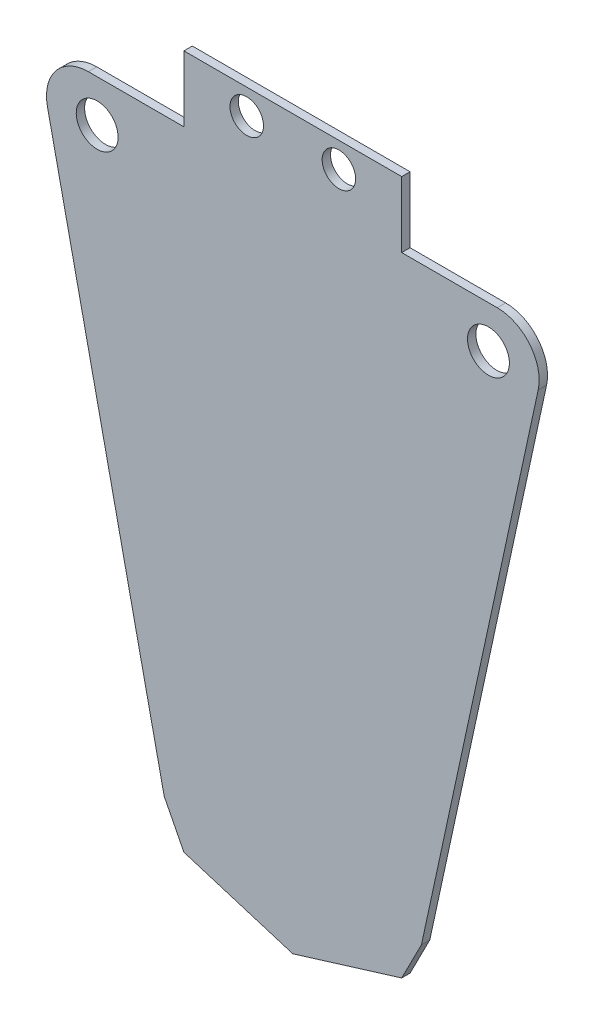
ISO-10303-21;
HEADER;
FILE_DESCRIPTION(('STEP AP214'),'2;1');
FILE_NAME('part.step','',(''),(''),'','','');
FILE_SCHEMA(('AUTOMOTIVE_DESIGN { 1 0 10303 214 1 1 1 1 }'));
ENDSEC;
DATA;
#1=APPLICATION_CONTEXT('core data for automotive mechanical design processes');
#2=APPLICATION_PROTOCOL_DEFINITION('international standard','automotive_design',2000,#1);
#3=PRODUCT_CONTEXT('',#1,'mechanical');
#4=PRODUCT('Part','Part','',(#3));
#5=PRODUCT_RELATED_PRODUCT_CATEGORY('part','',(#4));
#6=PRODUCT_DEFINITION_FORMATION('','',#4);
#7=PRODUCT_DEFINITION_CONTEXT('part definition',#1,'design');
#8=PRODUCT_DEFINITION('design','',#6,#7);
#9=PRODUCT_DEFINITION_SHAPE('','',#8);
#10=(LENGTH_UNIT() NAMED_UNIT(*) SI_UNIT(.MILLI.,.METRE.));
#11=(NAMED_UNIT(*) PLANE_ANGLE_UNIT() SI_UNIT($,.RADIAN.));
#12=(NAMED_UNIT(*) SI_UNIT($,.STERADIAN.) SOLID_ANGLE_UNIT());
#13=UNCERTAINTY_MEASURE_WITH_UNIT(LENGTH_MEASURE(1.E-05),#10,'distance_accuracy_value','');
#14=(GEOMETRIC_REPRESENTATION_CONTEXT(3) GLOBAL_UNCERTAINTY_ASSIGNED_CONTEXT((#13)) GLOBAL_UNIT_ASSIGNED_CONTEXT((#10,
#11,#12)) REPRESENTATION_CONTEXT('',''));
#15=CARTESIAN_POINT('',(0.,0.,0.));
#16=DIRECTION('',(0.,0.,1.));
#17=DIRECTION('',(1.,0.,0.));
#18=AXIS2_PLACEMENT_3D('',#15,#16,#17);
#19=CARTESIAN_POINT('',(25.9999999999999,-150.,-30.0000000000001));
#20=DIRECTION('',(0.294085848837525,-0.955779008721949,0.));
#21=DIRECTION('',(0.955779008721948,0.294085848837524,0.));
#22=AXIS2_PLACEMENT_3D('',#19,#20,#21);
#23=PLANE('',#22);
#24=DIRECTION('',(0.,0.,-1.));
#25=VECTOR('',#24,1.);
#26=CARTESIAN_POINT('',(25.9999999999999,-150.,-30.0000000000001));
#27=LINE('',#26,#25);
#28=CARTESIAN_POINT('',(25.9999999999997,-150.,-28.0000000000001));
#29=VERTEX_POINT('',#28);
#30=CARTESIAN_POINT('',(26.,-150.000000000002,-30.0000000000001));
#31=VERTEX_POINT('',#30);
#32=EDGE_CURVE('E307',#29,#31,#27,.T.);
#33=ORIENTED_EDGE('',*,*,#32,.F.);
#34=DIRECTION('',(0.955779008721948,0.294085848837524,0.));
#35=VECTOR('',#34,1.);
#36=CARTESIAN_POINT('',(25.9999999999999,-150.,-28.0000000000001));
#37=LINE('',#36,#35);
#38=CARTESIAN_POINT('',(-1.2490009027033E-13,-157.999999999999,-28.0000000000001));
#39=VERTEX_POINT('',#38);
#40=EDGE_CURVE('E289',#39,#29,#37,.T.);
#41=ORIENTED_EDGE('',*,*,#40,.F.);
#42=DIRECTION('',(0.,0.,-1.));
#43=VECTOR('',#42,1.);
#44=CARTESIAN_POINT('',(0.,-157.999999999999,-30.0000000000001));
#45=LINE('',#44,#43);
#46=CARTESIAN_POINT('',(0.,-157.999999999999,-30.0000000000001));
#47=VERTEX_POINT('',#46);
#48=EDGE_CURVE('E299',#39,#47,#45,.T.);
#49=ORIENTED_EDGE('',*,*,#48,.T.);
#50=DIRECTION('',(0.955779008721948,0.294085848837524,0.));
#51=VECTOR('',#50,1.);
#52=CARTESIAN_POINT('',(25.9999999999999,-150.,-30.0000000000001));
#53=LINE('',#52,#51);
#54=EDGE_CURVE('E293',#47,#31,#53,.T.);
#55=ORIENTED_EDGE('',*,*,#54,.T.);
#56=EDGE_LOOP('',(#33,#41,#49,#55));
#57=FACE_BOUND('',#56,.T.);
#58=ADVANCED_FACE('F86',(#57),#23,.T.);
#59=CARTESIAN_POINT('',(0.,-157.999999999999,-30.0000000000001));
#60=DIRECTION('',(-0.294085848837527,-0.955779008721949,0.));
#61=DIRECTION('',(0.955779008721947,-0.294085848837526,0.));
#62=AXIS2_PLACEMENT_3D('',#59,#60,#61);
#63=PLANE('',#62);
#64=ORIENTED_EDGE('',*,*,#48,.F.);
#65=DIRECTION('',(0.955779008721947,-0.294085848837526,0.));
#66=VECTOR('',#65,1.);
#67=CARTESIAN_POINT('',(0.,-157.999999999999,-28.0000000000001));
#68=LINE('',#67,#66);
#69=CARTESIAN_POINT('',(-25.9999999999999,-150.,-28.0000000000001));
#70=VERTEX_POINT('',#69);
#71=EDGE_CURVE('E296',#70,#39,#68,.T.);
#72=ORIENTED_EDGE('',*,*,#71,.F.);
#73=DIRECTION('',(0.,0.,-1.));
#74=VECTOR('',#73,1.);
#75=CARTESIAN_POINT('',(-25.9999999999999,-150.,-30.0000000000001));
#76=LINE('',#75,#74);
#77=CARTESIAN_POINT('',(-25.9999999999999,-150.,-30.0000000000001));
#78=VERTEX_POINT('',#77);
#79=EDGE_CURVE('E304',#70,#78,#76,.T.);
#80=ORIENTED_EDGE('',*,*,#79,.T.);
#81=DIRECTION('',(0.955779008721947,-0.294085848837526,0.));
#82=VECTOR('',#81,1.);
#83=CARTESIAN_POINT('',(0.,-157.999999999999,-30.0000000000001));
#84=LINE('',#83,#82);
#85=EDGE_CURVE('E295',#78,#47,#84,.T.);
#86=ORIENTED_EDGE('',*,*,#85,.T.);
#87=EDGE_LOOP('',(#64,#72,#80,#86));
#88=FACE_BOUND('',#87,.T.);
#89=ADVANCED_FACE('F348',(#88),#63,.T.);
#90=CARTESIAN_POINT('',(-25.9999999999999,-150.,-30.0000000000001));
#91=DIRECTION('',(0.,0.,1.));
#92=DIRECTION('',(0.999999999999998,0.,0.));
#93=AXIS2_PLACEMENT_3D('',#90,#91,#92);
#94=PLANE('',#93);
#95=ORIENTED_EDGE('',*,*,#85,.F.);
#96=DIRECTION('',(-0.454685701384504,0.890651959497357,0.));
#97=VECTOR('',#96,1.);
#98=CARTESIAN_POINT('',(-26.,-150.000000000002,-30.0000000000001));
#99=LINE('',#98,#97);
#100=CARTESIAN_POINT('',(-30.7123883849302,-140.7692326014,-30.0000000000001));
#101=VERTEX_POINT('',#100);
#102=EDGE_CURVE('E284',#78,#101,#99,.T.);
#103=ORIENTED_EDGE('',*,*,#102,.T.);
#104=DIRECTION('',(-0.211753347005807,0.977323140026803,0.));
#105=VECTOR('',#104,1.);
#106=CARTESIAN_POINT('',(-31.1337215208195,-138.824621809317,-30.0000000390462));
#107=LINE('',#106,#105);
#108=CARTESIAN_POINT('',(-58.5869239906599,-12.1175334869782,-30.0000000390462));
#109=VERTEX_POINT('',#108);
#110=EDGE_CURVE('E267',#101,#109,#107,.T.);
#111=ORIENTED_EDGE('',*,*,#110,.T.);
#112=CARTESIAN_POINT('',(-48.8136925903919,-10.0000000169203,-30.0000000390462));
#113=DIRECTION('',(0.,0.,0.999999999999998));
#114=DIRECTION('',(0.,1.00000000000001,0.));
#115=AXIS2_PLACEMENT_3D('',#112,#113,#114);
#116=CIRCLE('',#115,10.);
#117=CARTESIAN_POINT('',(-48.8136925903919,-1.69200209398923E-08,-30.0000000390462));
#118=VERTEX_POINT('',#117);
#119=EDGE_CURVE('E276',#118,#109,#116,.T.);
#120=ORIENTED_EDGE('',*,*,#119,.F.);
#121=DIRECTION('',(-1.,0.,0.));
#122=VECTOR('',#121,1.);
#123=CARTESIAN_POINT('',(-28.3561944901923,9.99200722162641E-13,-30.0000000000001));
#124=LINE('',#123,#122);
#125=CARTESIAN_POINT('',(-26.,9.99200722162641E-13,-30.0000000000001));
#126=VERTEX_POINT('',#125);
#127=EDGE_CURVE('E287',#118,#126,#124,.F.);
#128=ORIENTED_EDGE('',*,*,#127,.T.);
#129=DIRECTION('',(0.,1.,0.));
#130=VECTOR('',#129,1.);
#131=CARTESIAN_POINT('',(-26.,2.35619449019456,-30.0000000000001));
#132=LINE('',#131,#130);
#133=CARTESIAN_POINT('',(-25.9999999999999,15.7123889803859,-30.0000000000007));
#134=VERTEX_POINT('',#133);
#135=EDGE_CURVE('E189',#126,#134,#132,.T.);
#136=ORIENTED_EDGE('',*,*,#135,.T.);
#137=DIRECTION('',(-0.999999999999998,0.,0.));
#138=VECTOR('',#137,1.);
#139=CARTESIAN_POINT('',(-25.9999999999999,15.7123889803859,-30.0000000000007));
#140=LINE('',#139,#138);
#141=CARTESIAN_POINT('',(25.9999999999999,15.712388980386,-30.0000000000007));
#142=VERTEX_POINT('',#141);
#143=EDGE_CURVE('E200',#142,#134,#140,.T.);
#144=ORIENTED_EDGE('',*,*,#143,.F.);
#145=DIRECTION('',(0.,1.,0.));
#146=VECTOR('',#145,1.);
#147=CARTESIAN_POINT('',(25.9999999999999,2.35619449019456,-30.));
#148=LINE('',#147,#146);
#149=CARTESIAN_POINT('',(25.9999999999999,2.60902410786912E-12,-30.));
#150=VERTEX_POINT('',#149);
#151=EDGE_CURVE('E196',#142,#150,#148,.F.);
#152=ORIENTED_EDGE('',*,*,#151,.T.);
#153=DIRECTION('',(-1.,0.,0.));
#154=VECTOR('',#153,1.);
#155=CARTESIAN_POINT('',(28.3561944901923,2.60902410786912E-12,-30.0000000000001));
#156=LINE('',#155,#154);
#157=CARTESIAN_POINT('',(48.8136925903917,1.69200209398923E-08,-30.));
#158=VERTEX_POINT('',#157);
#159=EDGE_CURVE('E248',#150,#158,#156,.F.);
#160=ORIENTED_EDGE('',*,*,#159,.T.);
#161=CARTESIAN_POINT('',(48.8136925903917,-9.99999998308021,-30.0000000000001));
#162=DIRECTION('',(0.,0.,0.999999999999998));
#163=DIRECTION('',(0.,-1.00000000000001,0.));
#164=AXIS2_PLACEMENT_3D('',#161,#162,#163);
#165=CIRCLE('',#164,10.);
#166=CARTESIAN_POINT('',(58.5869239906597,-12.1175334531382,-30.));
#167=VERTEX_POINT('',#166);
#168=EDGE_CURVE('E244',#167,#158,#165,.T.);
#169=ORIENTED_EDGE('',*,*,#168,.F.);
#170=DIRECTION('',(-0.211753347005807,-0.977323140026803,0.));
#171=VECTOR('',#170,1.);
#172=CARTESIAN_POINT('',(31.1337215208194,-138.824621775477,-30.0000000000001));
#173=LINE('',#172,#171);
#174=CARTESIAN_POINT('',(30.7123883849303,-140.769233500561,-29.9999999999999));
#175=VERTEX_POINT('',#174);
#176=EDGE_CURVE('E236',#167,#175,#173,.T.);
#177=ORIENTED_EDGE('',*,*,#176,.T.);
#178=DIRECTION('',(-0.454685727399049,-0.890651946216701,0.));
#179=VECTOR('',#178,1.);
#180=CARTESIAN_POINT('',(30.7123877894759,-140.769234433567,-30.0000000000001));
#181=LINE('',#180,#179);
#182=EDGE_CURVE('E250',#175,#31,#181,.T.);
#183=ORIENTED_EDGE('',*,*,#182,.T.);
#184=ORIENTED_EDGE('',*,*,#54,.F.);
#185=EDGE_LOOP('',(#95,#103,#111,#120,#128,#136,#144,#152,#160,#169,#177,#183,#184));
#186=FACE_BOUND('',#185,.T.);
#187=CARTESIAN_POINT('',(-46.7123895758389,-10.0000000169215,-30.0000000390462));
#188=DIRECTION('',(0.,0.,0.999999999999998));
#189=DIRECTION('',(0.,1.00000000000001,0.));
#190=AXIS2_PLACEMENT_3D('',#187,#188,#189);
#191=CIRCLE('',#190,5.);
#192=CARTESIAN_POINT('',(-46.7123895758389,-5.00000001692145,-30.0000000390462));
#193=VERTEX_POINT('',#192);
#194=EDGE_CURVE('E270',#193,#193,#191,.T.);
#195=ORIENTED_EDGE('',*,*,#194,.T.);
#196=EDGE_LOOP('',(#195));
#197=FACE_BOUND('',#196,.T.);
#198=CARTESIAN_POINT('',(46.7123895758388,-9.99999998308143,-30.0000000000001));
#199=DIRECTION('',(0.,0.,0.999999999999998));
#200=DIRECTION('',(0.,-1.00000000000001,0.));
#201=AXIS2_PLACEMENT_3D('',#198,#199,#200);
#202=CIRCLE('',#201,5.);
#203=CARTESIAN_POINT('',(46.7123895758388,-14.9999999830815,-30.0000000000001));
#204=VERTEX_POINT('',#203);
#205=EDGE_CURVE('E238',#204,#204,#202,.T.);
#206=ORIENTED_EDGE('',*,*,#205,.T.);
#207=EDGE_LOOP('',(#206));
#208=FACE_BOUND('',#207,.T.);
#209=CARTESIAN_POINT('',(-11.,9.71238898038576,-30.0000000000021));
#210=DIRECTION('',(0.,0.,-1.00000000000001));
#211=DIRECTION('',(0.,1.,0.));
#212=AXIS2_PLACEMENT_3D('',#209,#210,#211);
#213=CIRCLE('',#212,4.);
#214=CARTESIAN_POINT('',(-11.,13.7123889803858,-30.0000000000021));
#215=VERTEX_POINT('',#214);
#216=EDGE_CURVE('E213',#215,#215,#213,.F.);
#217=ORIENTED_EDGE('',*,*,#216,.T.);
#218=EDGE_LOOP('',(#217));
#219=FACE_BOUND('',#218,.T.);
#220=CARTESIAN_POINT('',(11.,9.71238898038576,-30.0000000000021));
#221=DIRECTION('',(0.,0.,-1.00000000000001));
#222=DIRECTION('',(0.,1.,0.));
#223=AXIS2_PLACEMENT_3D('',#220,#221,#222);
#224=CIRCLE('',#223,3.99999999999994);
#225=CARTESIAN_POINT('',(11.,13.7123889803857,-30.0000000000021));
#226=VERTEX_POINT('',#225);
#227=EDGE_CURVE('E208',#226,#226,#224,.F.);
#228=ORIENTED_EDGE('',*,*,#227,.T.);
#229=EDGE_LOOP('',(#228));
#230=FACE_BOUND('',#229,.T.);
#231=ADVANCED_FACE('F88',(#186,#197,#208,#219,#230),#94,.F.);
#232=CARTESIAN_POINT('',(-25.9999999999999,-150.,-28.0000000000001));
#233=DIRECTION('',(0.,0.,1.));
#234=DIRECTION('',(0.999999999999998,0.,0.));
#235=AXIS2_PLACEMENT_3D('',#232,#233,#234);
#236=PLANE('',#235);
#237=ORIENTED_EDGE('',*,*,#40,.T.);
#238=DIRECTION('',(-0.454685727399049,-0.890651946216701,0.));
#239=VECTOR('',#238,1.);
#240=CARTESIAN_POINT('',(30.7123877894759,-140.769234433567,-28.0000000000001));
#241=LINE('',#240,#239);
#242=CARTESIAN_POINT('',(30.71238838493,-140.769233500561,-28.0000000000001));
#243=VERTEX_POINT('',#242);
#244=EDGE_CURVE('E251',#243,#29,#241,.T.);
#245=ORIENTED_EDGE('',*,*,#244,.F.);
#246=DIRECTION('',(-0.211753347005807,-0.977323140026803,0.));
#247=VECTOR('',#246,1.);
#248=CARTESIAN_POINT('',(31.1337215208194,-138.824621775477,-28.0000000000001));
#249=LINE('',#248,#247);
#250=CARTESIAN_POINT('',(58.5869239906596,-12.1175334531367,-28.0000000000001));
#251=VERTEX_POINT('',#250);
#252=EDGE_CURVE('E229',#251,#243,#249,.T.);
#253=ORIENTED_EDGE('',*,*,#252,.F.);
#254=CARTESIAN_POINT('',(48.8136925903917,-9.99999998308021,-28.0000000000001));
#255=DIRECTION('',(0.,0.,0.999999999999998));
#256=DIRECTION('',(0.,-1.,0.));
#257=AXIS2_PLACEMENT_3D('',#254,#255,#256);
#258=CIRCLE('',#257,10.);
#259=CARTESIAN_POINT('',(48.8136925903915,1.6921630763278E-08,-28.0000000000001));
#260=VERTEX_POINT('',#259);
#261=EDGE_CURVE('E231',#251,#260,#258,.T.);
#262=ORIENTED_EDGE('',*,*,#261,.T.);
#263=DIRECTION('',(-1.,0.,0.));
#264=VECTOR('',#263,1.);
#265=CARTESIAN_POINT('',(28.3561944901923,2.60902410786912E-12,-28.0000000000001));
#266=LINE('',#265,#264);
#267=CARTESIAN_POINT('',(25.9999999999997,2.33146835171283E-12,-28.0000000000001));
#268=VERTEX_POINT('',#267);
#269=EDGE_CURVE('E101',#268,#260,#266,.F.);
#270=ORIENTED_EDGE('',*,*,#269,.F.);
#271=DIRECTION('',(0.,1.,0.));
#272=VECTOR('',#271,1.);
#273=CARTESIAN_POINT('',(25.9999999999999,2.35619449019456,-28.0000000000001));
#274=LINE('',#273,#272);
#275=CARTESIAN_POINT('',(26.0000000000004,15.7123889803862,-28.0000000000022));
#276=VERTEX_POINT('',#275);
#277=EDGE_CURVE('E181',#276,#268,#274,.F.);
#278=ORIENTED_EDGE('',*,*,#277,.F.);
#279=DIRECTION('',(1.00000000000001,0.,0.));
#280=VECTOR('',#279,1.);
#281=CARTESIAN_POINT('',(0.,15.7123889803862,-28.0000000000022));
#282=LINE('',#281,#280);
#283=CARTESIAN_POINT('',(-26.0000000000003,15.7123889803862,-28.0000000000022));
#284=VERTEX_POINT('',#283);
#285=EDGE_CURVE('E187',#276,#284,#282,.F.);
#286=ORIENTED_EDGE('',*,*,#285,.T.);
#287=DIRECTION('',(0.,1.,0.));
#288=VECTOR('',#287,1.);
#289=CARTESIAN_POINT('',(-26.,2.35619449019456,-28.0000000000001));
#290=LINE('',#289,#288);
#291=CARTESIAN_POINT('',(-25.9999999999997,2.77555756156289E-12,-28.));
#292=VERTEX_POINT('',#291);
#293=EDGE_CURVE('E190',#292,#284,#290,.T.);
#294=ORIENTED_EDGE('',*,*,#293,.F.);
#295=DIRECTION('',(-1.,0.,0.));
#296=VECTOR('',#295,1.);
#297=CARTESIAN_POINT('',(-28.3561944901923,9.99200722162641E-13,-28.0000000000001));
#298=LINE('',#297,#296);
#299=CARTESIAN_POINT('',(-48.8136925903917,-1.69184111165066E-08,-28.0000000390462));
#300=VERTEX_POINT('',#299);
#301=EDGE_CURVE('E109',#300,#292,#298,.F.);
#302=ORIENTED_EDGE('',*,*,#301,.F.);
#303=CARTESIAN_POINT('',(-48.8136925903919,-10.0000000169203,-28.0000000390463));
#304=DIRECTION('',(0.,0.,0.999999999999998));
#305=DIRECTION('',(0.,1.,0.));
#306=AXIS2_PLACEMENT_3D('',#303,#304,#305);
#307=CIRCLE('',#306,10.);
#308=CARTESIAN_POINT('',(-58.5869239906597,-12.1175334869768,-28.0000000390462));
#309=VERTEX_POINT('',#308);
#310=EDGE_CURVE('E258',#300,#309,#307,.T.);
#311=ORIENTED_EDGE('',*,*,#310,.T.);
#312=DIRECTION('',(-0.211753347005807,0.977323140026803,0.));
#313=VECTOR('',#312,1.);
#314=CARTESIAN_POINT('',(-31.1337215208195,-138.824621809317,-28.0000000390462));
#315=LINE('',#314,#313);
#316=CARTESIAN_POINT('',(-30.7123889803844,-140.769233534402,-28.0000000390462));
#317=VERTEX_POINT('',#316);
#318=EDGE_CURVE('E264',#317,#309,#315,.T.);
#319=ORIENTED_EDGE('',*,*,#318,.F.);
#320=DIRECTION('',(-0.454685701384504,0.890651959497357,0.));
#321=VECTOR('',#320,1.);
#322=CARTESIAN_POINT('',(-26.,-150.000000000002,-28.0000000000001));
#323=LINE('',#322,#321);
#324=EDGE_CURVE('E261',#70,#317,#323,.T.);
#325=ORIENTED_EDGE('',*,*,#324,.F.);
#326=ORIENTED_EDGE('',*,*,#71,.T.);
#327=EDGE_LOOP('',(#237,#245,#253,#262,#270,#278,#286,#294,#302,#311,#319,#325,#326));
#328=FACE_BOUND('',#327,.T.);
#329=CARTESIAN_POINT('',(-46.7123895758389,-10.0000000169215,-28.0000000390463));
#330=DIRECTION('',(0.,0.,0.999999999999998));
#331=DIRECTION('',(0.,1.,0.));
#332=AXIS2_PLACEMENT_3D('',#329,#330,#331);
#333=CIRCLE('',#332,5.);
#334=CARTESIAN_POINT('',(-46.7123895758389,-5.00000001692147,-28.0000000390463));
#335=VERTEX_POINT('',#334);
#336=EDGE_CURVE('E273',#335,#335,#333,.T.);
#337=ORIENTED_EDGE('',*,*,#336,.F.);
#338=EDGE_LOOP('',(#337));
#339=FACE_BOUND('',#338,.T.);
#340=CARTESIAN_POINT('',(46.7123895758388,-9.99999998308143,-28.0000000000001));
#341=DIRECTION('',(0.,0.,0.999999999999998));
#342=DIRECTION('',(0.,-1.,0.));
#343=AXIS2_PLACEMENT_3D('',#340,#341,#342);
#344=CIRCLE('',#343,5.);
#345=CARTESIAN_POINT('',(46.7123895758388,-14.9999999830814,-28.0000000000001));
#346=VERTEX_POINT('',#345);
#347=EDGE_CURVE('E241',#346,#346,#344,.T.);
#348=ORIENTED_EDGE('',*,*,#347,.F.);
#349=EDGE_LOOP('',(#348));
#350=FACE_BOUND('',#349,.T.);
#351=CARTESIAN_POINT('',(-11.,9.71238898038576,-28.0000000000021));
#352=DIRECTION('',(0.,0.,-1.00000000000001));
#353=DIRECTION('',(0.,1.,0.));
#354=AXIS2_PLACEMENT_3D('',#351,#352,#353);
#355=CIRCLE('',#354,4.);
#356=CARTESIAN_POINT('',(-11.,13.7123889803858,-28.0000000000021));
#357=VERTEX_POINT('',#356);
#358=EDGE_CURVE('E216',#357,#357,#355,.F.);
#359=ORIENTED_EDGE('',*,*,#358,.F.);
#360=EDGE_LOOP('',(#359));
#361=FACE_BOUND('',#360,.T.);
#362=CARTESIAN_POINT('',(11.,9.71238898038576,-28.0000000000021));
#363=DIRECTION('',(0.,0.,-1.00000000000001));
#364=DIRECTION('',(0.,1.,0.));
#365=AXIS2_PLACEMENT_3D('',#362,#363,#364);
#366=CIRCLE('',#365,3.99999999999994);
#367=CARTESIAN_POINT('',(11.,13.7123889803857,-28.0000000000021));
#368=VERTEX_POINT('',#367);
#369=EDGE_CURVE('E219',#368,#368,#366,.F.);
#370=ORIENTED_EDGE('',*,*,#369,.F.);
#371=EDGE_LOOP('',(#370));
#372=FACE_BOUND('',#371,.T.);
#373=ADVANCED_FACE('F183',(#328,#339,#350,#361,#372),#236,.T.);
#374=CARTESIAN_POINT('',(-26.,-150.000000000002,-29.0000000000001));
#375=DIRECTION('',(-0.890651959497357,-0.454685701384504,0.));
#376=DIRECTION('',(-0.454685701384504,0.890651959497357,0.));
#377=AXIS2_PLACEMENT_3D('',#374,#375,#376);
#378=PLANE('',#377);
#379=ORIENTED_EDGE('',*,*,#79,.F.);
#380=ORIENTED_EDGE('',*,*,#324,.T.);
#381=DIRECTION('',(0.,0.,-0.999999999999998));
#382=VECTOR('',#381,1.);
#383=CARTESIAN_POINT('',(-30.7123889803847,-140.769233534402,-30.0000000390462));
#384=LINE('',#383,#382);
#385=EDGE_CURVE('E254',#317,#101,#384,.T.);
#386=ORIENTED_EDGE('',*,*,#385,.T.);
#387=ORIENTED_EDGE('',*,*,#102,.F.);
#388=EDGE_LOOP('',(#379,#380,#386,#387));
#389=FACE_BOUND('',#388,.T.);
#390=ADVANCED_FACE('F326',(#389),#378,.T.);
#391=CARTESIAN_POINT('',(-28.3561944901923,9.99200722162641E-13,-29.0000000000001));
#392=DIRECTION('',(0.,-1.,0.));
#393=DIRECTION('',(-1.,0.,0.));
#394=AXIS2_PLACEMENT_3D('',#391,#392,#393);
#395=PLANE('',#394);
#396=ORIENTED_EDGE('',*,*,#301,.T.);
#397=DIRECTION('',(1.24900090270331E-13,-2.83193607453215E-13,-1.));
#398=VECTOR('',#397,1.);
#399=CARTESIAN_POINT('',(-25.9999999999999,2.22044604925031E-12,-30.));
#400=LINE('',#399,#398);
#401=EDGE_CURVE('E94',#292,#126,#400,.T.);
#402=ORIENTED_EDGE('',*,*,#401,.T.);
#403=ORIENTED_EDGE('',*,*,#127,.F.);
#404=DIRECTION('',(0.,0.,-0.999999999999998));
#405=VECTOR('',#404,1.);
#406=CARTESIAN_POINT('',(-48.8136925903919,-1.69200209398923E-08,-30.0000000390462));
#407=LINE('',#406,#405);
#408=EDGE_CURVE('E279',#300,#118,#407,.T.);
#409=ORIENTED_EDGE('',*,*,#408,.F.);
#410=EDGE_LOOP('',(#396,#402,#403,#409));
#411=FACE_BOUND('',#410,.T.);
#412=ADVANCED_FACE('F310',(#411),#395,.F.);
#413=CARTESIAN_POINT('',(-48.8136925903919,-10.0000000169203,-30.0000000390462));
#414=DIRECTION('',(0.,0.,0.999999999999998));
#415=DIRECTION('',(0.,1.,0.));
#416=AXIS2_PLACEMENT_3D('',#413,#414,#415);
#417=CYLINDRICAL_SURFACE('',#416,10.);
#418=DIRECTION('',(0.,0.,-0.999999999999998));
#419=VECTOR('',#418,1.);
#420=CARTESIAN_POINT('',(-58.5869239906599,-12.1175334869782,-30.0000000390462));
#421=LINE('',#420,#419);
#422=EDGE_CURVE('E262',#309,#109,#421,.T.);
#423=ORIENTED_EDGE('',*,*,#422,.F.);
#424=ORIENTED_EDGE('',*,*,#310,.F.);
#425=ORIENTED_EDGE('',*,*,#408,.T.);
#426=ORIENTED_EDGE('',*,*,#119,.T.);
#427=EDGE_LOOP('',(#423,#424,#425,#426));
#428=FACE_BOUND('',#427,.T.);
#429=ADVANCED_FACE('F317',(#428),#417,.T.);
#430=CARTESIAN_POINT('',(-46.7123895758389,-10.0000000169215,-30.0000000390462));
#431=DIRECTION('',(0.,0.,0.999999999999998));
#432=DIRECTION('',(0.,1.,0.));
#433=AXIS2_PLACEMENT_3D('',#430,#431,#432);
#434=CYLINDRICAL_SURFACE('',#433,5.);
#435=ORIENTED_EDGE('',*,*,#194,.F.);
#436=EDGE_LOOP('',(#435));
#437=FACE_BOUND('',#436,.T.);
#438=ORIENTED_EDGE('',*,*,#336,.T.);
#439=EDGE_LOOP('',(#438));
#440=FACE_BOUND('',#439,.T.);
#441=ADVANCED_FACE('F365',(#437,#440),#434,.F.);
#442=CARTESIAN_POINT('',(-31.1337215208195,-138.824621809317,-30.0000000390462));
#443=DIRECTION('',(0.977323140026797,0.211753347005806,0.));
#444=DIRECTION('',(-0.211753347005807,0.977323140026803,0.));
#445=AXIS2_PLACEMENT_3D('',#442,#443,#444);
#446=PLANE('',#445);
#447=ORIENTED_EDGE('',*,*,#318,.T.);
#448=ORIENTED_EDGE('',*,*,#422,.T.);
#449=ORIENTED_EDGE('',*,*,#110,.F.);
#450=ORIENTED_EDGE('',*,*,#385,.F.);
#451=EDGE_LOOP('',(#447,#448,#449,#450));
#452=FACE_BOUND('',#451,.T.);
#453=ADVANCED_FACE('F322',(#452),#446,.F.);
#454=CARTESIAN_POINT('',(28.3561944901923,2.60902410786912E-12,-29.0000000000001));
#455=DIRECTION('',(0.,-1.,0.));
#456=DIRECTION('',(-1.,0.,0.));
#457=AXIS2_PLACEMENT_3D('',#454,#455,#456);
#458=PLANE('',#457);
#459=DIRECTION('',(0.,-4.02455846426618E-13,-1.));
#460=VECTOR('',#459,1.);
#461=CARTESIAN_POINT('',(25.9999999999999,2.22044604925031E-12,-30.));
#462=LINE('',#461,#460);
#463=EDGE_CURVE('E12',#268,#150,#462,.T.);
#464=ORIENTED_EDGE('',*,*,#463,.F.);
#465=ORIENTED_EDGE('',*,*,#269,.T.);
#466=DIRECTION('',(0.,0.,-0.999999999999998));
#467=VECTOR('',#466,1.);
#468=CARTESIAN_POINT('',(48.8136925903917,1.69200209398923E-08,-30.));
#469=LINE('',#468,#467);
#470=EDGE_CURVE('E233',#260,#158,#469,.T.);
#471=ORIENTED_EDGE('',*,*,#470,.T.);
#472=ORIENTED_EDGE('',*,*,#159,.F.);
#473=EDGE_LOOP('',(#464,#465,#471,#472));
#474=FACE_BOUND('',#473,.T.);
#475=ADVANCED_FACE('F345',(#474),#458,.F.);
#476=CARTESIAN_POINT('',(30.7123877894759,-140.769234433567,-29.0000000000001));
#477=DIRECTION('',(0.890651946216701,-0.454685727399049,0.));
#478=DIRECTION('',(-0.454685727399049,-0.890651946216701,0.));
#479=AXIS2_PLACEMENT_3D('',#476,#477,#478);
#480=PLANE('',#479);
#481=ORIENTED_EDGE('',*,*,#244,.T.);
#482=ORIENTED_EDGE('',*,*,#32,.T.);
#483=ORIENTED_EDGE('',*,*,#182,.F.);
#484=DIRECTION('',(-2.97727155264098E-07,0.,-0.999999999999956));
#485=VECTOR('',#484,1.);
#486=CARTESIAN_POINT('',(30.7123883849303,-140.769233500561,-29.9999999999999));
#487=LINE('',#486,#485);
#488=EDGE_CURVE('E226',#243,#175,#487,.T.);
#489=ORIENTED_EDGE('',*,*,#488,.F.);
#490=EDGE_LOOP('',(#481,#482,#483,#489));
#491=FACE_BOUND('',#490,.T.);
#492=ADVANCED_FACE('F336',(#491),#480,.T.);
#493=CARTESIAN_POINT('',(48.8136925903917,-9.99999998308021,-30.0000000000001));
#494=DIRECTION('',(0.,0.,0.999999999999998));
#495=DIRECTION('',(0.,-1.,0.));
#496=AXIS2_PLACEMENT_3D('',#493,#494,#495);
#497=CYLINDRICAL_SURFACE('',#496,10.);
#498=ORIENTED_EDGE('',*,*,#470,.F.);
#499=ORIENTED_EDGE('',*,*,#261,.F.);
#500=DIRECTION('',(0.,0.,-0.999999999999998));
#501=VECTOR('',#500,1.);
#502=CARTESIAN_POINT('',(58.5869239906597,-12.1175334531382,-30.));
#503=LINE('',#502,#501);
#504=EDGE_CURVE('E224',#251,#167,#503,.T.);
#505=ORIENTED_EDGE('',*,*,#504,.T.);
#506=ORIENTED_EDGE('',*,*,#168,.T.);
#507=EDGE_LOOP('',(#498,#499,#505,#506));
#508=FACE_BOUND('',#507,.T.);
#509=ADVANCED_FACE('F342',(#508),#497,.T.);
#510=CARTESIAN_POINT('',(46.7123895758388,-9.99999998308143,-30.0000000000001));
#511=DIRECTION('',(0.,0.,0.999999999999998));
#512=DIRECTION('',(0.,-1.,0.));
#513=AXIS2_PLACEMENT_3D('',#510,#511,#512);
#514=CYLINDRICAL_SURFACE('',#513,5.);
#515=ORIENTED_EDGE('',*,*,#205,.F.);
#516=EDGE_LOOP('',(#515));
#517=FACE_BOUND('',#516,.T.);
#518=ORIENTED_EDGE('',*,*,#347,.T.);
#519=EDGE_LOOP('',(#518));
#520=FACE_BOUND('',#519,.T.);
#521=ADVANCED_FACE('F377',(#517,#520),#514,.F.);
#522=CARTESIAN_POINT('',(31.1337215208194,-138.824621775477,-30.0000000000001));
#523=DIRECTION('',(-0.977323140026797,0.211753347005806,0.));
#524=DIRECTION('',(-0.211753347005807,-0.977323140026803,0.));
#525=AXIS2_PLACEMENT_3D('',#522,#523,#524);
#526=PLANE('',#525);
#527=ORIENTED_EDGE('',*,*,#504,.F.);
#528=ORIENTED_EDGE('',*,*,#252,.T.);
#529=ORIENTED_EDGE('',*,*,#488,.T.);
#530=ORIENTED_EDGE('',*,*,#176,.F.);
#531=EDGE_LOOP('',(#527,#528,#529,#530));
#532=FACE_BOUND('',#531,.T.);
#533=ADVANCED_FACE('F347',(#532),#526,.F.);
#534=CARTESIAN_POINT('',(-26.,2.35619449019456,-29.0000000000001));
#535=DIRECTION('',(-1.,0.,0.));
#536=DIRECTION('',(0.,1.,0.));
#537=AXIS2_PLACEMENT_3D('',#534,#535,#536);
#538=PLANE('',#537);
#539=ORIENTED_EDGE('',*,*,#401,.F.);
#540=ORIENTED_EDGE('',*,*,#293,.T.);
#541=DIRECTION('',(0.,0.,-1.00000000000001));
#542=VECTOR('',#541,1.);
#543=CARTESIAN_POINT('',(-25.9999999999999,15.7123889803859,-30.0000000000007));
#544=LINE('',#543,#542);
#545=EDGE_CURVE('E205',#284,#134,#544,.T.);
#546=ORIENTED_EDGE('',*,*,#545,.T.);
#547=ORIENTED_EDGE('',*,*,#135,.F.);
#548=EDGE_LOOP('',(#539,#540,#546,#547));
#549=FACE_BOUND('',#548,.T.);
#550=ADVANCED_FACE('F312',(#549),#538,.T.);
#551=CARTESIAN_POINT('',(25.9999999999999,2.35619449019456,-29.0000000000001));
#552=DIRECTION('',(-1.,0.,0.));
#553=DIRECTION('',(0.,1.,0.));
#554=AXIS2_PLACEMENT_3D('',#551,#552,#553);
#555=PLANE('',#554);
#556=ORIENTED_EDGE('',*,*,#277,.T.);
#557=ORIENTED_EDGE('',*,*,#463,.T.);
#558=ORIENTED_EDGE('',*,*,#151,.F.);
#559=DIRECTION('',(0.,0.,-1.00000000000001));
#560=VECTOR('',#559,1.);
#561=CARTESIAN_POINT('',(25.9999999999999,15.712388980386,-30.0000000000007));
#562=LINE('',#561,#560);
#563=EDGE_CURVE('E193',#276,#142,#562,.T.);
#564=ORIENTED_EDGE('',*,*,#563,.F.);
#565=EDGE_LOOP('',(#556,#557,#558,#564));
#566=FACE_BOUND('',#565,.T.);
#567=ADVANCED_FACE('F194',(#566),#555,.F.);
#568=CARTESIAN_POINT('',(-25.9999999999999,15.7123889803859,-30.0000000000007));
#569=DIRECTION('',(0.,-1.,0.));
#570=DIRECTION('',(-0.999999999999998,0.,0.));
#571=AXIS2_PLACEMENT_3D('',#568,#569,#570);
#572=PLANE('',#571);
#573=ORIENTED_EDGE('',*,*,#545,.F.);
#574=ORIENTED_EDGE('',*,*,#285,.F.);
#575=ORIENTED_EDGE('',*,*,#563,.T.);
#576=ORIENTED_EDGE('',*,*,#143,.T.);
#577=EDGE_LOOP('',(#573,#574,#575,#576));
#578=FACE_BOUND('',#577,.T.);
#579=ADVANCED_FACE('F203',(#578),#572,.F.);
#580=CARTESIAN_POINT('',(11.,9.71238898038576,-30.0000000000021));
#581=DIRECTION('',(0.,0.,-1.00000000000001));
#582=DIRECTION('',(0.,1.,0.));
#583=AXIS2_PLACEMENT_3D('',#580,#581,#582);
#584=CYLINDRICAL_SURFACE('',#583,3.99999999999994);
#585=ORIENTED_EDGE('',*,*,#227,.F.);
#586=EDGE_LOOP('',(#585));
#587=FACE_BOUND('',#586,.T.);
#588=ORIENTED_EDGE('',*,*,#369,.T.);
#589=EDGE_LOOP('',(#588));
#590=FACE_BOUND('',#589,.T.);
#591=ADVANCED_FACE('F390',(#587,#590),#584,.F.);
#592=CARTESIAN_POINT('',(-11.,9.71238898038576,-30.0000000000021));
#593=DIRECTION('',(0.,0.,-1.00000000000001));
#594=DIRECTION('',(0.,1.,0.));
#595=AXIS2_PLACEMENT_3D('',#592,#593,#594);
#596=CYLINDRICAL_SURFACE('',#595,4.);
#597=ORIENTED_EDGE('',*,*,#216,.F.);
#598=EDGE_LOOP('',(#597));
#599=FACE_BOUND('',#598,.T.);
#600=ORIENTED_EDGE('',*,*,#358,.T.);
#601=EDGE_LOOP('',(#600));
#602=FACE_BOUND('',#601,.T.);
#603=ADVANCED_FACE('F387',(#599,#602),#596,.F.);
#604=CLOSED_SHELL('',(#58,#89,#231,#373,#390,#412,#429,#441,#453,#475,#492,#509,#521,#533,#550,
#567,#579,#591,#603));
#605=MANIFOLD_SOLID_BREP('B2',#604);
#606=ADVANCED_BREP_SHAPE_REPRESENTATION('',(#18,#605),#14);
#607=SHAPE_DEFINITION_REPRESENTATION(#9,#606);
ENDSEC;
END-ISO-10303-21;
